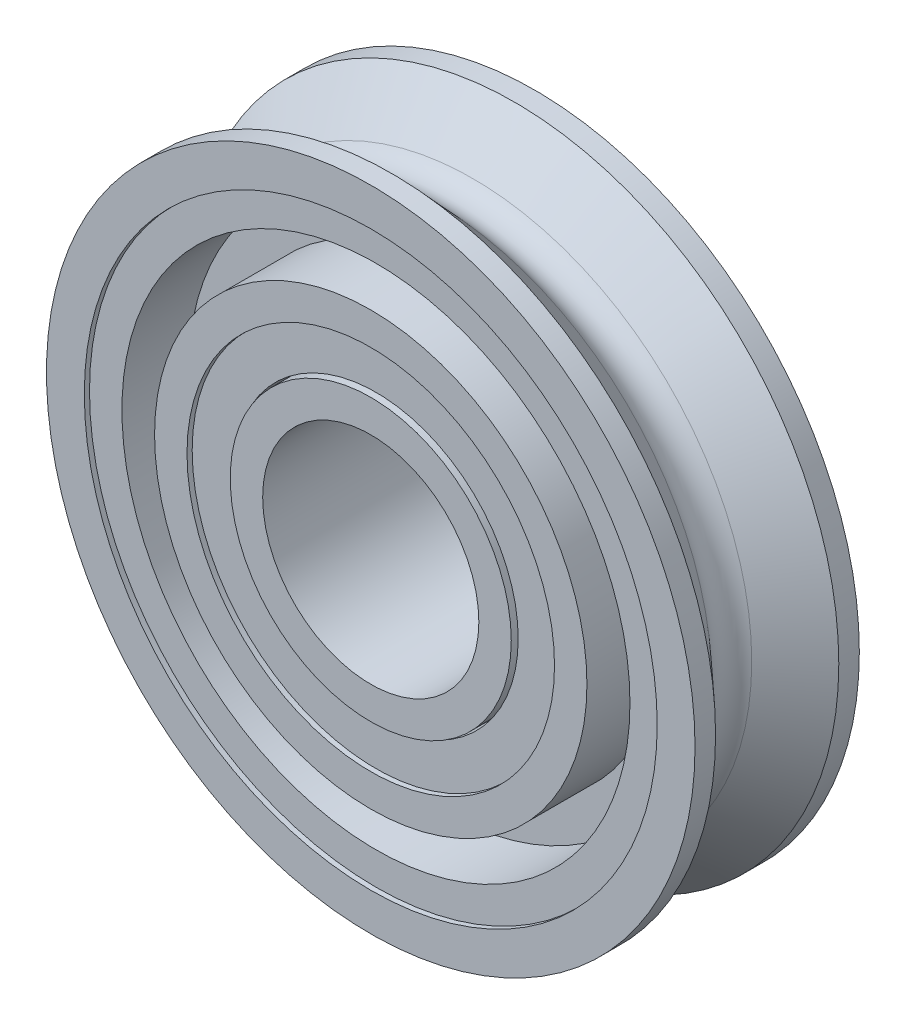
ISO-10303-21;
HEADER;
FILE_DESCRIPTION(('STEP AP214'),'2;1');
FILE_NAME('part.step','',(''),(''),'','','');
FILE_SCHEMA(('AUTOMOTIVE_DESIGN { 1 0 10303 214 1 1 1 1 }'));
ENDSEC;
DATA;
#1=APPLICATION_CONTEXT('core data for automotive mechanical design processes');
#2=APPLICATION_PROTOCOL_DEFINITION('international standard','automotive_design',2000,#1);
#3=PRODUCT_CONTEXT('',#1,'mechanical');
#4=PRODUCT('Part','Part','',(#3));
#5=PRODUCT_RELATED_PRODUCT_CATEGORY('part','',(#4));
#6=PRODUCT_DEFINITION_FORMATION('','',#4);
#7=PRODUCT_DEFINITION_CONTEXT('part definition',#1,'design');
#8=PRODUCT_DEFINITION('design','',#6,#7);
#9=PRODUCT_DEFINITION_SHAPE('','',#8);
#10=(LENGTH_UNIT() NAMED_UNIT(*) SI_UNIT(.MILLI.,.METRE.));
#11=(NAMED_UNIT(*) PLANE_ANGLE_UNIT() SI_UNIT($,.RADIAN.));
#12=(NAMED_UNIT(*) SI_UNIT($,.STERADIAN.) SOLID_ANGLE_UNIT());
#13=UNCERTAINTY_MEASURE_WITH_UNIT(LENGTH_MEASURE(1.E-05),#10,'distance_accuracy_value','');
#14=(GEOMETRIC_REPRESENTATION_CONTEXT(3) GLOBAL_UNCERTAINTY_ASSIGNED_CONTEXT((#13)) GLOBAL_UNIT_ASSIGNED_CONTEXT((#10,
#11,#12)) REPRESENTATION_CONTEXT('',''));
#15=CARTESIAN_POINT('',(0.,0.,0.));
#16=DIRECTION('',(0.,0.,1.));
#17=DIRECTION('',(1.,0.,0.));
#18=AXIS2_PLACEMENT_3D('',#15,#16,#17);
#19=CARTESIAN_POINT('',(0.,0.,0.));
#20=DIRECTION('',(0.,0.,1.));
#21=DIRECTION('',(1.,0.,0.));
#22=AXIS2_PLACEMENT_3D('',#19,#20,#21);
#23=TOROIDAL_SURFACE('',#22,4.365625,0.396875000000001);
#24=CARTESIAN_POINT('',(0.,0.,0.291970508518326));
#25=DIRECTION('',(0.,0.,1.));
#26=DIRECTION('',(1.,0.,0.));
#27=AXIS2_PLACEMENT_3D('',#24,#25,#26);
#28=CIRCLE('',#27,4.09680724057821);
#29=CARTESIAN_POINT('',(4.09680724057821,0.,0.291970508518326));
#30=VERTEX_POINT('',#29);
#31=EDGE_CURVE('E68',#30,#30,#28,.T.);
#32=ORIENTED_EDGE('',*,*,#31,.F.);
#33=EDGE_LOOP('',(#32));
#34=FACE_BOUND('',#33,.T.);
#35=CARTESIAN_POINT('',(0.,0.,-0.291970508518326));
#36=DIRECTION('',(0.,0.,1.));
#37=DIRECTION('',(1.,0.,0.));
#38=AXIS2_PLACEMENT_3D('',#35,#36,#37);
#39=CIRCLE('',#38,4.09680724057821);
#40=CARTESIAN_POINT('',(4.09680724057821,0.,-0.291970508518326));
#41=VERTEX_POINT('',#40);
#42=EDGE_CURVE('E66',#41,#41,#39,.T.);
#43=ORIENTED_EDGE('',*,*,#42,.T.);
#44=EDGE_LOOP('',(#43));
#45=FACE_BOUND('',#44,.T.);
#46=ADVANCED_FACE('F50',(#34,#45),#23,.F.);
#47=CARTESIAN_POINT('',(0.,0.,0.291970508518326));
#48=DIRECTION('',(0.,0.,1.));
#49=DIRECTION('',(1.,0.,0.));
#50=AXIS2_PLACEMENT_3D('',#47,#48,#49);
#51=CONICAL_SURFACE('',#50,4.09680724057821,0.826660809078657);
#52=CARTESIAN_POINT('',(0.,0.,0.904875));
#53=DIRECTION('',(0.,0.,1.));
#54=DIRECTION('',(1.,0.,0.));
#55=AXIS2_PLACEMENT_3D('',#52,#53,#54);
#56=CIRCLE('',#55,4.7625);
#57=CARTESIAN_POINT('',(4.7625,0.,0.904875));
#58=VERTEX_POINT('',#57);
#59=EDGE_CURVE('E72',#58,#58,#56,.T.);
#60=ORIENTED_EDGE('',*,*,#59,.F.);
#61=EDGE_LOOP('',(#60));
#62=FACE_BOUND('',#61,.T.);
#63=ORIENTED_EDGE('',*,*,#31,.T.);
#64=EDGE_LOOP('',(#63));
#65=FACE_BOUND('',#64,.T.);
#66=ADVANCED_FACE('F188',(#62,#65),#51,.T.);
#67=CARTESIAN_POINT('',(0.,0.,1.2065));
#68=DIRECTION('',(0.,0.,1.));
#69=DIRECTION('',(1.,0.,0.));
#70=AXIS2_PLACEMENT_3D('',#67,#68,#69);
#71=CYLINDRICAL_SURFACE('',#70,4.7625);
#72=CARTESIAN_POINT('',(0.,0.,1.2065));
#73=DIRECTION('',(0.,0.,1.));
#74=DIRECTION('',(1.,0.,0.));
#75=AXIS2_PLACEMENT_3D('',#72,#73,#74);
#76=CIRCLE('',#75,4.7625);
#77=CARTESIAN_POINT('',(4.7625,0.,1.2065));
#78=VERTEX_POINT('',#77);
#79=EDGE_CURVE('E77',#78,#78,#76,.T.);
#80=ORIENTED_EDGE('',*,*,#79,.F.);
#81=EDGE_LOOP('',(#80));
#82=FACE_BOUND('',#81,.T.);
#83=ORIENTED_EDGE('',*,*,#59,.T.);
#84=EDGE_LOOP('',(#83));
#85=FACE_BOUND('',#84,.T.);
#86=ADVANCED_FACE('F194',(#82,#85),#71,.T.);
#87=CARTESIAN_POINT('',(0.,4.206875,1.2065));
#88=DIRECTION('',(0.,0.,-1.));
#89=DIRECTION('',(-1.,0.,0.));
#90=AXIS2_PLACEMENT_3D('',#87,#88,#89);
#91=PLANE('',#90);
#92=CARTESIAN_POINT('',(0.,0.,1.2065));
#93=DIRECTION('',(0.,0.,1.));
#94=DIRECTION('',(1.,0.,0.));
#95=AXIS2_PLACEMENT_3D('',#92,#93,#94);
#96=CIRCLE('',#95,4.206875);
#97=CARTESIAN_POINT('',(4.206875,0.,1.2065));
#98=VERTEX_POINT('',#97);
#99=EDGE_CURVE('E84',#98,#98,#96,.T.);
#100=ORIENTED_EDGE('',*,*,#99,.F.);
#101=EDGE_LOOP('',(#100));
#102=FACE_BOUND('',#101,.T.);
#103=ORIENTED_EDGE('',*,*,#79,.T.);
#104=EDGE_LOOP('',(#103));
#105=FACE_BOUND('',#104,.T.);
#106=ADVANCED_FACE('F200',(#102,#105),#91,.F.);
#107=CARTESIAN_POINT('',(0.,0.,1.2065));
#108=DIRECTION('',(0.,0.,1.));
#109=DIRECTION('',(1.,0.,0.));
#110=AXIS2_PLACEMENT_3D('',#107,#108,#109);
#111=CYLINDRICAL_SURFACE('',#110,4.206875);
#112=CARTESIAN_POINT('',(0.,0.,1.1303));
#113=DIRECTION('',(0.,0.,1.));
#114=DIRECTION('',(1.,0.,0.));
#115=AXIS2_PLACEMENT_3D('',#112,#113,#114);
#116=CIRCLE('',#115,4.206875);
#117=CARTESIAN_POINT('',(4.206875,0.,1.1303));
#118=VERTEX_POINT('',#117);
#119=EDGE_CURVE('E87',#118,#118,#116,.T.);
#120=ORIENTED_EDGE('',*,*,#119,.F.);
#121=EDGE_LOOP('',(#120));
#122=FACE_BOUND('',#121,.T.);
#123=ORIENTED_EDGE('',*,*,#99,.T.);
#124=EDGE_LOOP('',(#123));
#125=FACE_BOUND('',#124,.T.);
#126=ADVANCED_FACE('F204',(#122,#125),#111,.F.);
#127=CARTESIAN_POINT('',(0.,4.206875,1.1303));
#128=DIRECTION('',(0.,0.,-1.));
#129=DIRECTION('',(-1.,0.,0.));
#130=AXIS2_PLACEMENT_3D('',#127,#128,#129);
#131=PLANE('',#130);
#132=CARTESIAN_POINT('',(0.,0.,1.1303));
#133=DIRECTION('',(0.,0.,1.));
#134=DIRECTION('',(1.,0.,0.));
#135=AXIS2_PLACEMENT_3D('',#132,#133,#134);
#136=CIRCLE('',#135,3.730625);
#137=CARTESIAN_POINT('',(3.730625,0.,1.1303));
#138=VERTEX_POINT('',#137);
#139=EDGE_CURVE('E90',#138,#138,#136,.T.);
#140=ORIENTED_EDGE('',*,*,#139,.F.);
#141=EDGE_LOOP('',(#140));
#142=FACE_BOUND('',#141,.T.);
#143=ORIENTED_EDGE('',*,*,#119,.T.);
#144=EDGE_LOOP('',(#143));
#145=FACE_BOUND('',#144,.T.);
#146=ADVANCED_FACE('F208',(#142,#145),#131,.F.);
#147=CARTESIAN_POINT('',(0.,0.,1.2065));
#148=DIRECTION('',(0.,0.,1.));
#149=DIRECTION('',(1.,0.,0.));
#150=AXIS2_PLACEMENT_3D('',#147,#148,#149);
#151=CYLINDRICAL_SURFACE('',#150,3.730625);
#152=CARTESIAN_POINT('',(0.,0.,0.1508125));
#153=DIRECTION('',(0.,0.,1.));
#154=DIRECTION('',(1.,0.,0.));
#155=AXIS2_PLACEMENT_3D('',#152,#153,#154);
#156=CIRCLE('',#155,3.730625);
#157=CARTESIAN_POINT('',(3.730625,0.,0.1508125));
#158=VERTEX_POINT('',#157);
#159=EDGE_CURVE('E93',#158,#158,#156,.T.);
#160=ORIENTED_EDGE('',*,*,#159,.F.);
#161=EDGE_LOOP('',(#160));
#162=FACE_BOUND('',#161,.T.);
#163=ORIENTED_EDGE('',*,*,#139,.T.);
#164=EDGE_LOOP('',(#163));
#165=FACE_BOUND('',#164,.T.);
#166=ADVANCED_FACE('F212',(#162,#165),#151,.F.);
#167=CARTESIAN_POINT('',(0.,3.730625,0.1508125));
#168=DIRECTION('',(0.,0.,-1.));
#169=DIRECTION('',(-1.,0.,0.));
#170=AXIS2_PLACEMENT_3D('',#167,#168,#169);
#171=PLANE('',#170);
#172=CARTESIAN_POINT('',(0.,0.,0.1508125));
#173=DIRECTION('',(0.,0.,1.));
#174=DIRECTION('',(1.,0.,0.));
#175=AXIS2_PLACEMENT_3D('',#172,#173,#174);
#176=CIRCLE('',#175,3.175);
#177=CARTESIAN_POINT('',(3.175,0.,0.1508125));
#178=VERTEX_POINT('',#177);
#179=EDGE_CURVE('E96',#178,#178,#176,.T.);
#180=ORIENTED_EDGE('',*,*,#179,.F.);
#181=EDGE_LOOP('',(#180));
#182=FACE_BOUND('',#181,.T.);
#183=ORIENTED_EDGE('',*,*,#159,.T.);
#184=EDGE_LOOP('',(#183));
#185=FACE_BOUND('',#184,.T.);
#186=ADVANCED_FACE('F216',(#182,#185),#171,.F.);
#187=CARTESIAN_POINT('',(0.,0.,1.2065));
#188=DIRECTION('',(0.,0.,1.));
#189=DIRECTION('',(1.,0.,0.));
#190=AXIS2_PLACEMENT_3D('',#187,#188,#189);
#191=CYLINDRICAL_SURFACE('',#190,3.175);
#192=CARTESIAN_POINT('',(0.,0.,1.2065));
#193=DIRECTION('',(0.,0.,1.));
#194=DIRECTION('',(1.,0.,0.));
#195=AXIS2_PLACEMENT_3D('',#192,#193,#194);
#196=CIRCLE('',#195,3.175);
#197=CARTESIAN_POINT('',(3.175,0.,1.2065));
#198=VERTEX_POINT('',#197);
#199=EDGE_CURVE('E99',#198,#198,#196,.T.);
#200=ORIENTED_EDGE('',*,*,#199,.F.);
#201=EDGE_LOOP('',(#200));
#202=FACE_BOUND('',#201,.T.);
#203=ORIENTED_EDGE('',*,*,#179,.T.);
#204=EDGE_LOOP('',(#203));
#205=FACE_BOUND('',#204,.T.);
#206=ADVANCED_FACE('F220',(#202,#205),#191,.T.);
#207=CARTESIAN_POINT('',(0.,2.69875,1.2065));
#208=DIRECTION('',(0.,0.,-1.));
#209=DIRECTION('',(-1.,0.,0.));
#210=AXIS2_PLACEMENT_3D('',#207,#208,#209);
#211=PLANE('',#210);
#212=CARTESIAN_POINT('',(0.,0.,1.2065));
#213=DIRECTION('',(0.,0.,1.));
#214=DIRECTION('',(1.,0.,0.));
#215=AXIS2_PLACEMENT_3D('',#212,#213,#214);
#216=CIRCLE('',#215,2.69875);
#217=CARTESIAN_POINT('',(2.69875,0.,1.2065));
#218=VERTEX_POINT('',#217);
#219=EDGE_CURVE('E102',#218,#218,#216,.T.);
#220=ORIENTED_EDGE('',*,*,#219,.F.);
#221=EDGE_LOOP('',(#220));
#222=FACE_BOUND('',#221,.T.);
#223=ORIENTED_EDGE('',*,*,#199,.T.);
#224=EDGE_LOOP('',(#223));
#225=FACE_BOUND('',#224,.T.);
#226=ADVANCED_FACE('F224',(#222,#225),#211,.F.);
#227=CARTESIAN_POINT('',(0.,0.,1.2065));
#228=DIRECTION('',(0.,0.,1.));
#229=DIRECTION('',(1.,0.,0.));
#230=AXIS2_PLACEMENT_3D('',#227,#228,#229);
#231=CYLINDRICAL_SURFACE('',#230,2.69875);
#232=CARTESIAN_POINT('',(0.,0.,1.1303));
#233=DIRECTION('',(0.,0.,1.));
#234=DIRECTION('',(1.,0.,0.));
#235=AXIS2_PLACEMENT_3D('',#232,#233,#234);
#236=CIRCLE('',#235,2.69875);
#237=CARTESIAN_POINT('',(2.69875,0.,1.1303));
#238=VERTEX_POINT('',#237);
#239=EDGE_CURVE('E105',#238,#238,#236,.T.);
#240=ORIENTED_EDGE('',*,*,#239,.F.);
#241=EDGE_LOOP('',(#240));
#242=FACE_BOUND('',#241,.T.);
#243=ORIENTED_EDGE('',*,*,#219,.T.);
#244=EDGE_LOOP('',(#243));
#245=FACE_BOUND('',#244,.T.);
#246=ADVANCED_FACE('F183',(#242,#245),#231,.F.);
#247=CARTESIAN_POINT('',(0.,2.06375,1.1303));
#248=DIRECTION('',(0.,0.,-1.));
#249=DIRECTION('',(-1.,0.,0.));
#250=AXIS2_PLACEMENT_3D('',#247,#248,#249);
#251=PLANE('',#250);
#252=CARTESIAN_POINT('',(0.,0.,1.1303));
#253=DIRECTION('',(0.,0.,-1.));
#254=DIRECTION('',(-1.,0.,0.));
#255=AXIS2_PLACEMENT_3D('',#252,#253,#254);
#256=CIRCLE('',#255,2.08915);
#257=CARTESIAN_POINT('',(-2.08915,0.,1.1303));
#258=VERTEX_POINT('',#257);
#259=EDGE_CURVE('E54',#258,#258,#256,.T.);
#260=ORIENTED_EDGE('',*,*,#259,.T.);
#261=EDGE_LOOP('',(#260));
#262=FACE_BOUND('',#261,.T.);
#263=ORIENTED_EDGE('',*,*,#239,.T.);
#264=EDGE_LOOP('',(#263));
#265=FACE_BOUND('',#264,.T.);
#266=ADVANCED_FACE('F177',(#262,#265),#251,.F.);
#267=CARTESIAN_POINT('',(0.,2.69875,-1.1303));
#268=DIRECTION('',(0.,0.,1.));
#269=DIRECTION('',(1.,0.,0.));
#270=AXIS2_PLACEMENT_3D('',#267,#268,#269);
#271=PLANE('',#270);
#272=CARTESIAN_POINT('',(0.,0.,-1.1303));
#273=DIRECTION('',(0.,0.,1.));
#274=DIRECTION('',(1.,0.,0.));
#275=AXIS2_PLACEMENT_3D('',#272,#273,#274);
#276=CIRCLE('',#275,2.08915);
#277=CARTESIAN_POINT('',(2.08915,0.,-1.1303));
#278=VERTEX_POINT('',#277);
#279=EDGE_CURVE('E80',#278,#278,#276,.T.);
#280=ORIENTED_EDGE('',*,*,#279,.T.);
#281=EDGE_LOOP('',(#280));
#282=FACE_BOUND('',#281,.T.);
#283=CARTESIAN_POINT('',(0.,0.,-1.1303));
#284=DIRECTION('',(0.,0.,1.));
#285=DIRECTION('',(1.,0.,0.));
#286=AXIS2_PLACEMENT_3D('',#283,#284,#285);
#287=CIRCLE('',#286,2.69875);
#288=CARTESIAN_POINT('',(2.69875,0.,-1.1303));
#289=VERTEX_POINT('',#288);
#290=EDGE_CURVE('E108',#289,#289,#287,.T.);
#291=ORIENTED_EDGE('',*,*,#290,.F.);
#292=EDGE_LOOP('',(#291));
#293=FACE_BOUND('',#292,.T.);
#294=ADVANCED_FACE('F172',(#282,#293),#271,.F.);
#295=CARTESIAN_POINT('',(0.,0.,1.2065));
#296=DIRECTION('',(0.,0.,1.));
#297=DIRECTION('',(1.,0.,0.));
#298=AXIS2_PLACEMENT_3D('',#295,#296,#297);
#299=CYLINDRICAL_SURFACE('',#298,2.69875);
#300=CARTESIAN_POINT('',(0.,0.,-1.2065));
#301=DIRECTION('',(0.,0.,1.));
#302=DIRECTION('',(1.,0.,0.));
#303=AXIS2_PLACEMENT_3D('',#300,#301,#302);
#304=CIRCLE('',#303,2.69875);
#305=CARTESIAN_POINT('',(2.69875,0.,-1.2065));
#306=VERTEX_POINT('',#305);
#307=EDGE_CURVE('E111',#306,#306,#304,.T.);
#308=ORIENTED_EDGE('',*,*,#307,.F.);
#309=EDGE_LOOP('',(#308));
#310=FACE_BOUND('',#309,.T.);
#311=ORIENTED_EDGE('',*,*,#290,.T.);
#312=EDGE_LOOP('',(#311));
#313=FACE_BOUND('',#312,.T.);
#314=ADVANCED_FACE('F166',(#310,#313),#299,.F.);
#315=CARTESIAN_POINT('',(0.,3.175,-1.2065));
#316=DIRECTION('',(0.,0.,1.));
#317=DIRECTION('',(1.,0.,0.));
#318=AXIS2_PLACEMENT_3D('',#315,#316,#317);
#319=PLANE('',#318);
#320=CARTESIAN_POINT('',(0.,0.,-1.2065));
#321=DIRECTION('',(0.,0.,1.));
#322=DIRECTION('',(1.,0.,0.));
#323=AXIS2_PLACEMENT_3D('',#320,#321,#322);
#324=CIRCLE('',#323,3.175);
#325=CARTESIAN_POINT('',(3.175,0.,-1.2065));
#326=VERTEX_POINT('',#325);
#327=EDGE_CURVE('E114',#326,#326,#324,.T.);
#328=ORIENTED_EDGE('',*,*,#327,.F.);
#329=EDGE_LOOP('',(#328));
#330=FACE_BOUND('',#329,.T.);
#331=ORIENTED_EDGE('',*,*,#307,.T.);
#332=EDGE_LOOP('',(#331));
#333=FACE_BOUND('',#332,.T.);
#334=ADVANCED_FACE('F160',(#330,#333),#319,.F.);
#335=CARTESIAN_POINT('',(0.,0.,1.2065));
#336=DIRECTION('',(0.,0.,1.));
#337=DIRECTION('',(1.,0.,0.));
#338=AXIS2_PLACEMENT_3D('',#335,#336,#337);
#339=CYLINDRICAL_SURFACE('',#338,3.175);
#340=CARTESIAN_POINT('',(0.,0.,-0.1508125));
#341=DIRECTION('',(0.,0.,1.));
#342=DIRECTION('',(1.,0.,0.));
#343=AXIS2_PLACEMENT_3D('',#340,#341,#342);
#344=CIRCLE('',#343,3.175);
#345=CARTESIAN_POINT('',(3.175,0.,-0.1508125));
#346=VERTEX_POINT('',#345);
#347=EDGE_CURVE('E117',#346,#346,#344,.T.);
#348=ORIENTED_EDGE('',*,*,#347,.F.);
#349=EDGE_LOOP('',(#348));
#350=FACE_BOUND('',#349,.T.);
#351=ORIENTED_EDGE('',*,*,#327,.T.);
#352=EDGE_LOOP('',(#351));
#353=FACE_BOUND('',#352,.T.);
#354=ADVANCED_FACE('F154',(#350,#353),#339,.T.);
#355=CARTESIAN_POINT('',(0.,3.730625,-0.1508125));
#356=DIRECTION('',(0.,0.,1.));
#357=DIRECTION('',(1.,0.,0.));
#358=AXIS2_PLACEMENT_3D('',#355,#356,#357);
#359=PLANE('',#358);
#360=CARTESIAN_POINT('',(0.,0.,-0.1508125));
#361=DIRECTION('',(0.,0.,1.));
#362=DIRECTION('',(1.,0.,0.));
#363=AXIS2_PLACEMENT_3D('',#360,#361,#362);
#364=CIRCLE('',#363,3.730625);
#365=CARTESIAN_POINT('',(3.730625,0.,-0.1508125));
#366=VERTEX_POINT('',#365);
#367=EDGE_CURVE('E120',#366,#366,#364,.T.);
#368=ORIENTED_EDGE('',*,*,#367,.F.);
#369=EDGE_LOOP('',(#368));
#370=FACE_BOUND('',#369,.T.);
#371=ORIENTED_EDGE('',*,*,#347,.T.);
#372=EDGE_LOOP('',(#371));
#373=FACE_BOUND('',#372,.T.);
#374=ADVANCED_FACE('F148',(#370,#373),#359,.F.);
#375=CARTESIAN_POINT('',(0.,0.,1.2065));
#376=DIRECTION('',(0.,0.,1.));
#377=DIRECTION('',(1.,0.,0.));
#378=AXIS2_PLACEMENT_3D('',#375,#376,#377);
#379=CYLINDRICAL_SURFACE('',#378,3.730625);
#380=CARTESIAN_POINT('',(0.,0.,-1.1303));
#381=DIRECTION('',(0.,0.,1.));
#382=DIRECTION('',(1.,0.,0.));
#383=AXIS2_PLACEMENT_3D('',#380,#381,#382);
#384=CIRCLE('',#383,3.730625);
#385=CARTESIAN_POINT('',(3.730625,0.,-1.1303));
#386=VERTEX_POINT('',#385);
#387=EDGE_CURVE('E123',#386,#386,#384,.T.);
#388=ORIENTED_EDGE('',*,*,#387,.F.);
#389=EDGE_LOOP('',(#388));
#390=FACE_BOUND('',#389,.T.);
#391=ORIENTED_EDGE('',*,*,#367,.T.);
#392=EDGE_LOOP('',(#391));
#393=FACE_BOUND('',#392,.T.);
#394=ADVANCED_FACE('F142',(#390,#393),#379,.F.);
#395=CARTESIAN_POINT('',(0.,4.206875,-1.1303));
#396=DIRECTION('',(0.,0.,1.));
#397=DIRECTION('',(1.,0.,0.));
#398=AXIS2_PLACEMENT_3D('',#395,#396,#397);
#399=PLANE('',#398);
#400=CARTESIAN_POINT('',(0.,0.,-1.1303));
#401=DIRECTION('',(0.,0.,1.));
#402=DIRECTION('',(1.,0.,0.));
#403=AXIS2_PLACEMENT_3D('',#400,#401,#402);
#404=CIRCLE('',#403,4.206875);
#405=CARTESIAN_POINT('',(4.206875,0.,-1.1303));
#406=VERTEX_POINT('',#405);
#407=EDGE_CURVE('E126',#406,#406,#404,.T.);
#408=ORIENTED_EDGE('',*,*,#407,.F.);
#409=EDGE_LOOP('',(#408));
#410=FACE_BOUND('',#409,.T.);
#411=ORIENTED_EDGE('',*,*,#387,.T.);
#412=EDGE_LOOP('',(#411));
#413=FACE_BOUND('',#412,.T.);
#414=ADVANCED_FACE('F136',(#410,#413),#399,.F.);
#415=CARTESIAN_POINT('',(0.,0.,1.2065));
#416=DIRECTION('',(0.,0.,1.));
#417=DIRECTION('',(1.,0.,0.));
#418=AXIS2_PLACEMENT_3D('',#415,#416,#417);
#419=CYLINDRICAL_SURFACE('',#418,4.206875);
#420=CARTESIAN_POINT('',(0.,0.,-1.2065));
#421=DIRECTION('',(0.,0.,1.));
#422=DIRECTION('',(1.,0.,0.));
#423=AXIS2_PLACEMENT_3D('',#420,#421,#422);
#424=CIRCLE('',#423,4.206875);
#425=CARTESIAN_POINT('',(4.206875,0.,-1.2065));
#426=VERTEX_POINT('',#425);
#427=EDGE_CURVE('E63',#426,#426,#424,.T.);
#428=ORIENTED_EDGE('',*,*,#427,.F.);
#429=EDGE_LOOP('',(#428));
#430=FACE_BOUND('',#429,.T.);
#431=ORIENTED_EDGE('',*,*,#407,.T.);
#432=EDGE_LOOP('',(#431));
#433=FACE_BOUND('',#432,.T.);
#434=ADVANCED_FACE('F133',(#430,#433),#419,.F.);
#435=CARTESIAN_POINT('',(0.,4.7625,-1.2065));
#436=DIRECTION('',(0.,0.,1.));
#437=DIRECTION('',(1.,0.,0.));
#438=AXIS2_PLACEMENT_3D('',#435,#436,#437);
#439=PLANE('',#438);
#440=CARTESIAN_POINT('',(0.,0.,-1.2065));
#441=DIRECTION('',(0.,0.,1.));
#442=DIRECTION('',(1.,0.,0.));
#443=AXIS2_PLACEMENT_3D('',#440,#441,#442);
#444=CIRCLE('',#443,4.7625);
#445=CARTESIAN_POINT('',(4.7625,0.,-1.2065));
#446=VERTEX_POINT('',#445);
#447=EDGE_CURVE('E58',#446,#446,#444,.T.);
#448=ORIENTED_EDGE('',*,*,#447,.F.);
#449=EDGE_LOOP('',(#448));
#450=FACE_BOUND('',#449,.T.);
#451=ORIENTED_EDGE('',*,*,#427,.T.);
#452=EDGE_LOOP('',(#451));
#453=FACE_BOUND('',#452,.T.);
#454=ADVANCED_FACE('F131',(#450,#453),#439,.F.);
#455=CARTESIAN_POINT('',(0.,0.,1.2065));
#456=DIRECTION('',(0.,0.,1.));
#457=DIRECTION('',(1.,0.,0.));
#458=AXIS2_PLACEMENT_3D('',#455,#456,#457);
#459=CYLINDRICAL_SURFACE('',#458,4.7625);
#460=CARTESIAN_POINT('',(0.,0.,-0.904875));
#461=DIRECTION('',(0.,0.,1.));
#462=DIRECTION('',(1.,0.,0.));
#463=AXIS2_PLACEMENT_3D('',#460,#461,#462);
#464=CIRCLE('',#463,4.7625);
#465=CARTESIAN_POINT('',(4.7625,0.,-0.904875));
#466=VERTEX_POINT('',#465);
#467=EDGE_CURVE('E12',#466,#466,#464,.T.);
#468=ORIENTED_EDGE('',*,*,#467,.F.);
#469=EDGE_LOOP('',(#468));
#470=FACE_BOUND('',#469,.T.);
#471=ORIENTED_EDGE('',*,*,#447,.T.);
#472=EDGE_LOOP('',(#471));
#473=FACE_BOUND('',#472,.T.);
#474=ADVANCED_FACE('F314',(#470,#473),#459,.T.);
#475=CARTESIAN_POINT('',(0.,0.,-0.904875));
#476=DIRECTION('',(0.,0.,-1.));
#477=DIRECTION('',(-1.,0.,0.));
#478=AXIS2_PLACEMENT_3D('',#475,#476,#477);
#479=CONICAL_SURFACE('',#478,4.7625,0.826660809078657);
#480=ORIENTED_EDGE('',*,*,#42,.F.);
#481=EDGE_LOOP('',(#480));
#482=FACE_BOUND('',#481,.T.);
#483=ORIENTED_EDGE('',*,*,#467,.T.);
#484=EDGE_LOOP('',(#483));
#485=FACE_BOUND('',#484,.T.);
#486=ADVANCED_FACE('F324',(#482,#485),#479,.T.);
#487=CARTESIAN_POINT('',(0.,0.,-1.2065));
#488=DIRECTION('',(0.,0.,1.));
#489=DIRECTION('',(1.,0.,0.));
#490=AXIS2_PLACEMENT_3D('',#487,#488,#489);
#491=CYLINDRICAL_SURFACE('',#490,2.08915);
#492=ORIENTED_EDGE('',*,*,#279,.F.);
#493=EDGE_LOOP('',(#492));
#494=FACE_BOUND('',#493,.T.);
#495=ORIENTED_EDGE('',*,*,#259,.F.);
#496=EDGE_LOOP('',(#495));
#497=FACE_BOUND('',#496,.T.);
#498=ADVANCED_FACE('F52',(#494,#497),#491,.F.);
#499=CLOSED_SHELL('',(#46,#66,#86,#106,#126,#146,#166,#186,#206,#226,#246,#266,#294,#314,#334,
#354,#374,#394,#414,#434,#454,#474,#486,#498));
#500=MANIFOLD_SOLID_BREP('B2',#499);
#501=CARTESIAN_POINT('',(0.,2.06375,1.2065));
#502=DIRECTION('',(0.,0.,-1.));
#503=DIRECTION('',(-1.,0.,0.));
#504=AXIS2_PLACEMENT_3D('',#501,#502,#503);
#505=PLANE('',#504);
#506=CARTESIAN_POINT('',(0.,0.,1.2065));
#507=DIRECTION('',(0.,0.,1.));
#508=DIRECTION('',(1.,0.,0.));
#509=AXIS2_PLACEMENT_3D('',#506,#507,#508);
#510=CIRCLE('',#509,1.5875);
#511=CARTESIAN_POINT('',(1.5875,0.,1.2065));
#512=VERTEX_POINT('',#511);
#513=EDGE_CURVE('E417',#512,#512,#510,.T.);
#514=ORIENTED_EDGE('',*,*,#513,.F.);
#515=EDGE_LOOP('',(#514));
#516=FACE_BOUND('',#515,.T.);
#517=CARTESIAN_POINT('',(0.,0.,1.2065));
#518=DIRECTION('',(0.,0.,1.));
#519=DIRECTION('',(1.,0.,0.));
#520=AXIS2_PLACEMENT_3D('',#517,#518,#519);
#521=CIRCLE('',#520,2.06375);
#522=CARTESIAN_POINT('',(2.06375,0.,1.2065));
#523=VERTEX_POINT('',#522);
#524=EDGE_CURVE('E49',#523,#523,#521,.T.);
#525=ORIENTED_EDGE('',*,*,#524,.T.);
#526=EDGE_LOOP('',(#525));
#527=FACE_BOUND('',#526,.T.);
#528=ADVANCED_FACE('F411',(#516,#527),#505,.F.);
#529=CARTESIAN_POINT('',(0.,0.,1.2065));
#530=DIRECTION('',(0.,0.,1.));
#531=DIRECTION('',(1.,0.,0.));
#532=AXIS2_PLACEMENT_3D('',#529,#530,#531);
#533=CYLINDRICAL_SURFACE('',#532,1.5875);
#534=CARTESIAN_POINT('',(0.,0.,-1.2065));
#535=DIRECTION('',(0.,0.,1.));
#536=DIRECTION('',(1.,0.,0.));
#537=AXIS2_PLACEMENT_3D('',#534,#535,#536);
#538=CIRCLE('',#537,1.5875);
#539=CARTESIAN_POINT('',(1.5875,0.,-1.2065));
#540=VERTEX_POINT('',#539);
#541=EDGE_CURVE('E421',#540,#540,#538,.T.);
#542=ORIENTED_EDGE('',*,*,#541,.F.);
#543=EDGE_LOOP('',(#542));
#544=FACE_BOUND('',#543,.T.);
#545=ORIENTED_EDGE('',*,*,#513,.T.);
#546=EDGE_LOOP('',(#545));
#547=FACE_BOUND('',#546,.T.);
#548=ADVANCED_FACE('F437',(#544,#547),#533,.F.);
#549=CARTESIAN_POINT('',(0.,2.06375,-1.2065));
#550=DIRECTION('',(0.,0.,1.));
#551=DIRECTION('',(1.,0.,0.));
#552=AXIS2_PLACEMENT_3D('',#549,#550,#551);
#553=PLANE('',#552);
#554=CARTESIAN_POINT('',(0.,0.,-1.2065));
#555=DIRECTION('',(0.,0.,1.));
#556=DIRECTION('',(1.,0.,0.));
#557=AXIS2_PLACEMENT_3D('',#554,#555,#556);
#558=CIRCLE('',#557,2.06375);
#559=CARTESIAN_POINT('',(2.06375,0.,-1.2065));
#560=VERTEX_POINT('',#559);
#561=EDGE_CURVE('E425',#560,#560,#558,.T.);
#562=ORIENTED_EDGE('',*,*,#561,.F.);
#563=EDGE_LOOP('',(#562));
#564=FACE_BOUND('',#563,.T.);
#565=ORIENTED_EDGE('',*,*,#541,.T.);
#566=EDGE_LOOP('',(#565));
#567=FACE_BOUND('',#566,.T.);
#568=ADVANCED_FACE('F434',(#564,#567),#553,.F.);
#569=CARTESIAN_POINT('',(0.,0.,1.2065));
#570=DIRECTION('',(0.,0.,1.));
#571=DIRECTION('',(1.,0.,0.));
#572=AXIS2_PLACEMENT_3D('',#569,#570,#571);
#573=CYLINDRICAL_SURFACE('',#572,2.06375);
#574=ORIENTED_EDGE('',*,*,#561,.T.);
#575=EDGE_LOOP('',(#574));
#576=FACE_BOUND('',#575,.T.);
#577=ORIENTED_EDGE('',*,*,#524,.F.);
#578=EDGE_LOOP('',(#577));
#579=FACE_BOUND('',#578,.T.);
#580=ADVANCED_FACE('F431',(#576,#579),#573,.T.);
#581=CLOSED_SHELL('',(#528,#548,#568,#580));
#582=MANIFOLD_SOLID_BREP('B7',#581);
#583=ADVANCED_BREP_SHAPE_REPRESENTATION('',(#18,#500,#582),#14);
#584=SHAPE_DEFINITION_REPRESENTATION(#9,#583);
ENDSEC;
END-ISO-10303-21;
